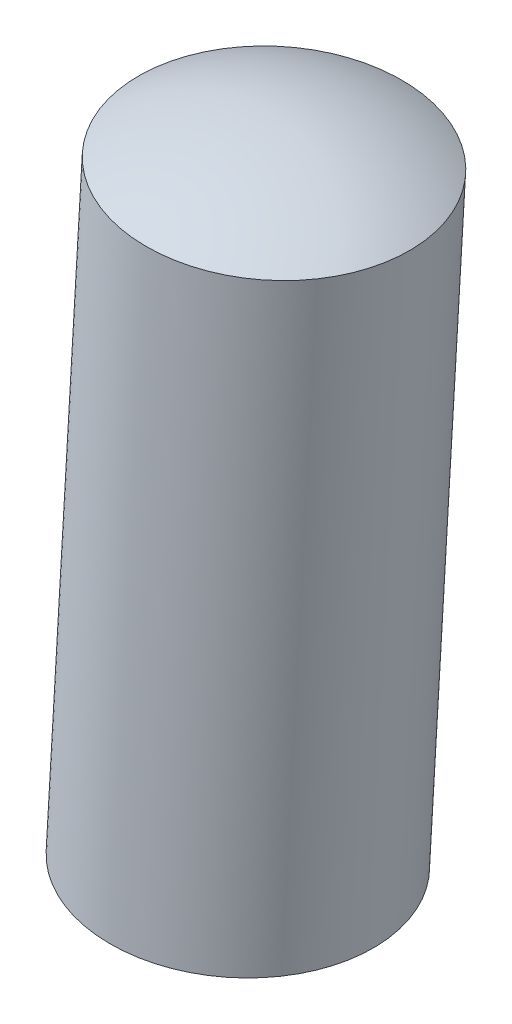
ISO-10303-21;
HEADER;
FILE_DESCRIPTION(('STEP AP214'),'2;1');
FILE_NAME('part.step','',(''),(''),'','','');
FILE_SCHEMA(('AUTOMOTIVE_DESIGN { 1 0 10303 214 1 1 1 1 }'));
ENDSEC;
DATA;
#1=APPLICATION_CONTEXT('core data for automotive mechanical design processes');
#2=APPLICATION_PROTOCOL_DEFINITION('international standard','automotive_design',2000,#1);
#3=PRODUCT_CONTEXT('',#1,'mechanical');
#4=PRODUCT('Part','Part','',(#3));
#5=PRODUCT_RELATED_PRODUCT_CATEGORY('part','',(#4));
#6=PRODUCT_DEFINITION_FORMATION('','',#4);
#7=PRODUCT_DEFINITION_CONTEXT('part definition',#1,'design');
#8=PRODUCT_DEFINITION('design','',#6,#7);
#9=PRODUCT_DEFINITION_SHAPE('','',#8);
#10=(LENGTH_UNIT() NAMED_UNIT(*) SI_UNIT(.MILLI.,.METRE.));
#11=(NAMED_UNIT(*) PLANE_ANGLE_UNIT() SI_UNIT($,.RADIAN.));
#12=(NAMED_UNIT(*) SI_UNIT($,.STERADIAN.) SOLID_ANGLE_UNIT());
#13=UNCERTAINTY_MEASURE_WITH_UNIT(LENGTH_MEASURE(1.E-05),#10,'distance_accuracy_value','');
#14=(GEOMETRIC_REPRESENTATION_CONTEXT(3) GLOBAL_UNCERTAINTY_ASSIGNED_CONTEXT((#13)) GLOBAL_UNIT_ASSIGNED_CONTEXT((#10,
#11,#12)) REPRESENTATION_CONTEXT('',''));
#15=CARTESIAN_POINT('',(0.,0.,0.));
#16=DIRECTION('',(0.,0.,1.));
#17=DIRECTION('',(1.,0.,0.));
#18=AXIS2_PLACEMENT_3D('',#15,#16,#17);
#19=CARTESIAN_POINT('',(-1.29442276156547,-22.2753714083145,0.599999999999989));
#20=DIRECTION('',(-0.998315875512799,0.0580121771623369,0.));
#21=DIRECTION('',(-0.0580121771623369,-0.998315875512799,0.));
#22=AXIS2_PLACEMENT_3D('',#19,#20,#21);
#23=SPHERICAL_SURFACE('',#22,2.);
#24=CARTESIAN_POINT('',(-1.29442276156547,-22.2753714083145,0.599999999999989));
#25=DIRECTION('',(0.0580121771623362,0.998315875512799,0.));
#26=DIRECTION('',(0.,0.,-1.));
#27=AXIS2_PLACEMENT_3D('',#24,#25,#26);
#28=SPHERICAL_SURFACE('',#27,2.);
#29=CARTESIAN_POINT('',(-1.3949027998684,-24.0045052267053,0.599999999999989));
#30=DIRECTION('',(0.0580121771623362,0.998315875512799,0.));
#31=DIRECTION('',(0.,0.,-1.));
#32=AXIS2_PLACEMENT_3D('',#29,#30,#31);
#33=CIRCLE('',#32,1.);
#34=CARTESIAN_POINT('',(-1.3949027998684,-24.0045052267053,-0.400000000000011));
#35=VERTEX_POINT('',#34);
#36=EDGE_CURVE('E11',#35,#35,#33,.T.);
#37=ORIENTED_EDGE('',*,*,#36,.F.);
#38=EDGE_LOOP('',(#37));
#39=FACE_BOUND('',#38,.T.);
#40=ADVANCED_FACE('F17',(#39),#28,.T.);
#41=CARTESIAN_POINT('',(-1.22910694499615,-21.1513691764923,0.599999999999989));
#42=DIRECTION('',(-0.998315875512799,0.0580121771623369,0.));
#43=DIRECTION('',(0.0580121771623362,0.998315875512799,0.));
#44=AXIS2_PLACEMENT_3D('',#41,#42,#43);
#45=SPHERICAL_SURFACE('',#44,2.);
#46=CARTESIAN_POINT('',(-1.22910694499615,-21.1513691764923,0.599999999999989));
#47=DIRECTION('',(0.0580121771623362,0.998315875512799,0.));
#48=DIRECTION('',(0.,0.,-1.));
#49=AXIS2_PLACEMENT_3D('',#46,#47,#48);
#50=SPHERICAL_SURFACE('',#49,2.);
#51=CARTESIAN_POINT('',(-1.12862690669328,-19.4222353581015,0.599999999999989));
#52=DIRECTION('',(0.0580121771623362,0.998315875512799,0.));
#53=DIRECTION('',(0.,0.,-1.));
#54=AXIS2_PLACEMENT_3D('',#51,#52,#53);
#55=CIRCLE('',#54,1.);
#56=CARTESIAN_POINT('',(-1.12862690669328,-19.4222353581015,-0.400000000000011));
#57=VERTEX_POINT('',#56);
#58=EDGE_CURVE('E25',#57,#57,#55,.T.);
#59=ORIENTED_EDGE('',*,*,#58,.T.);
#60=EDGE_LOOP('',(#59));
#61=FACE_BOUND('',#60,.T.);
#62=ADVANCED_FACE('F39',(#61),#50,.T.);
#63=CARTESIAN_POINT('',(-1.19519587998699,-20.5678028252524,0.599999999999989));
#64=DIRECTION('',(0.0580121771623362,0.998315875512799,0.));
#65=DIRECTION('',(0.,0.,-1.));
#66=AXIS2_PLACEMENT_3D('',#63,#64,#65);
#67=CYLINDRICAL_SURFACE('',#66,1.);
#68=ORIENTED_EDGE('',*,*,#36,.T.);
#69=EDGE_LOOP('',(#68));
#70=FACE_BOUND('',#69,.T.);
#71=ORIENTED_EDGE('',*,*,#58,.F.);
#72=EDGE_LOOP('',(#71));
#73=FACE_BOUND('',#72,.T.);
#74=ADVANCED_FACE('F47',(#70,#73),#67,.T.);
#75=CLOSED_SHELL('',(#40,#62,#74));
#76=MANIFOLD_SOLID_BREP('B1',#75);
#77=ADVANCED_BREP_SHAPE_REPRESENTATION('',(#18,#76),#14);
#78=SHAPE_DEFINITION_REPRESENTATION(#9,#77);
ENDSEC;
END-ISO-10303-21;
